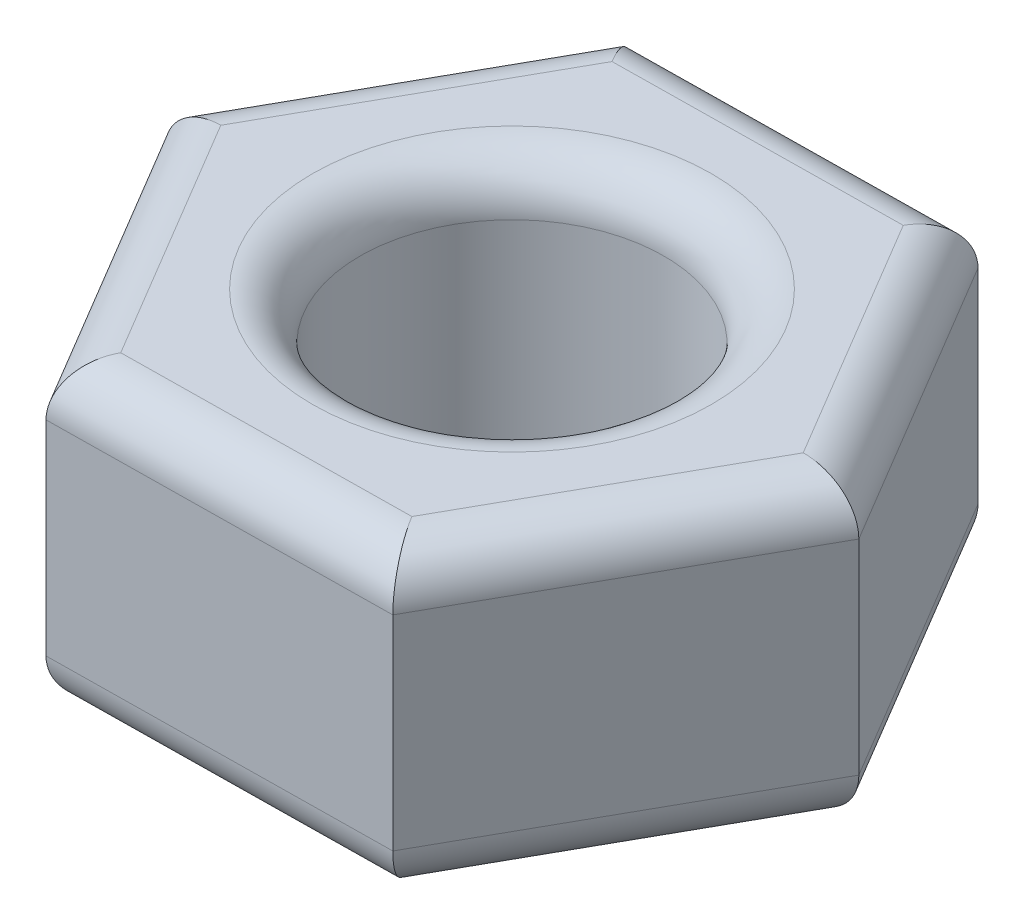
ISO-10303-21;
HEADER;
FILE_DESCRIPTION(('STEP AP214'),'2;1');
FILE_NAME('part.step','',(''),(''),'','','');
FILE_SCHEMA(('AUTOMOTIVE_DESIGN { 1 0 10303 214 1 1 1 1 }'));
ENDSEC;
DATA;
#1=APPLICATION_CONTEXT('core data for automotive mechanical design processes');
#2=APPLICATION_PROTOCOL_DEFINITION('international standard','automotive_design',2000,#1);
#3=PRODUCT_CONTEXT('',#1,'mechanical');
#4=PRODUCT('Part','Part','',(#3));
#5=PRODUCT_RELATED_PRODUCT_CATEGORY('part','',(#4));
#6=PRODUCT_DEFINITION_FORMATION('','',#4);
#7=PRODUCT_DEFINITION_CONTEXT('part definition',#1,'design');
#8=PRODUCT_DEFINITION('design','',#6,#7);
#9=PRODUCT_DEFINITION_SHAPE('','',#8);
#10=(LENGTH_UNIT() NAMED_UNIT(*) SI_UNIT(.MILLI.,.METRE.));
#11=(NAMED_UNIT(*) PLANE_ANGLE_UNIT() SI_UNIT($,.RADIAN.));
#12=(NAMED_UNIT(*) SI_UNIT($,.STERADIAN.) SOLID_ANGLE_UNIT());
#13=UNCERTAINTY_MEASURE_WITH_UNIT(LENGTH_MEASURE(1.E-05),#10,'distance_accuracy_value','');
#14=(GEOMETRIC_REPRESENTATION_CONTEXT(3) GLOBAL_UNCERTAINTY_ASSIGNED_CONTEXT((#13)) GLOBAL_UNIT_ASSIGNED_CONTEXT((#10,
#11,#12)) REPRESENTATION_CONTEXT('',''));
#15=CARTESIAN_POINT('',(0.,0.,0.));
#16=DIRECTION('',(0.,0.,1.));
#17=DIRECTION('',(1.,0.,0.));
#18=AXIS2_PLACEMENT_3D('',#15,#16,#17);
#19=CARTESIAN_POINT('',(0.,6.3,0.));
#20=DIRECTION('',(0.,1.,0.));
#21=DIRECTION('',(0.,0.,1.));
#22=AXIS2_PLACEMENT_3D('',#19,#20,#21);
#23=PLANE('',#22);
#24=CARTESIAN_POINT('',(0.,6.3,0.));
#25=DIRECTION('',(0.,1.,0.));
#26=DIRECTION('',(0.,0.,1.));
#27=AXIS2_PLACEMENT_3D('',#24,#25,#26);
#28=CIRCLE('',#27,4.2);
#29=CARTESIAN_POINT('',(0.,6.3,4.2));
#30=VERTEX_POINT('',#29);
#31=EDGE_CURVE('E11',#30,#30,#28,.F.);
#32=ORIENTED_EDGE('',*,*,#31,.T.);
#33=EDGE_LOOP('',(#32));
#34=FACE_BOUND('',#33,.T.);
#35=DIRECTION('',(0.488603073499745,0.,-0.872506181391629));
#36=VECTOR('',#35,1.);
#37=CARTESIAN_POINT('',(6.32687501312497,6.3,-0.582998073580469));
#38=LINE('',#37,#36);
#39=CARTESIAN_POINT('',(3.09102799993877,6.3,5.19530475374317));
#40=VERTEX_POINT('',#39);
#41=CARTESIAN_POINT('',(6.04477989711302,6.3,-0.0792563948844009));
#42=VERTEX_POINT('',#41);
#43=EDGE_CURVE('E51',#40,#42,#38,.T.);
#44=ORIENTED_EDGE('',*,*,#43,.T.);
#45=DIRECTION('',(-0.511310981294231,0.,-0.85939576471375));
#46=VECTOR('',#45,1.);
#47=CARTESIAN_POINT('',(2.6585463644844,6.3,-5.77073352472547));
#48=LINE('',#47,#46);
#49=CARTESIAN_POINT('',(2.95375189717424,6.3,-5.27456114862756));
#50=VERTEX_POINT('',#49);
#51=EDGE_CURVE('E43',#42,#50,#48,.T.);
#52=ORIENTED_EDGE('',*,*,#51,.T.);
#53=DIRECTION('',(-0.999914054793977,0.,0.0131104166778805));
#54=VECTOR('',#53,1.);
#55=CARTESIAN_POINT('',(-3.66832864864057,6.3,-5.18773545114499));
#56=LINE('',#55,#54);
#57=CARTESIAN_POINT('',(-3.09102799993877,6.3,-5.19530475374315));
#58=VERTEX_POINT('',#57);
#59=EDGE_CURVE('E190',#50,#58,#56,.T.);
#60=ORIENTED_EDGE('',*,*,#59,.T.);
#61=DIRECTION('',(-0.488603073499745,0.,0.872506181391629));
#62=VECTOR('',#61,1.);
#63=CARTESIAN_POINT('',(-6.32687501312497,6.3,0.582998073580482));
#64=LINE('',#63,#62);
#65=CARTESIAN_POINT('',(-6.04477989711301,6.3,0.0792563948844128));
#66=VERTEX_POINT('',#65);
#67=EDGE_CURVE('E192',#58,#66,#64,.T.);
#68=ORIENTED_EDGE('',*,*,#67,.T.);
#69=DIRECTION('',(0.511310981294231,0.,0.85939576471375));
#70=VECTOR('',#69,1.);
#71=CARTESIAN_POINT('',(-2.6585463644844,6.3,5.77073352472548));
#72=LINE('',#71,#70);
#73=CARTESIAN_POINT('',(-2.95375189717423,6.3,5.27456114862758));
#74=VERTEX_POINT('',#73);
#75=EDGE_CURVE('E194',#66,#74,#72,.T.);
#76=ORIENTED_EDGE('',*,*,#75,.T.);
#77=DIRECTION('',(0.999914054793977,0.,-0.0131104166778789));
#78=VECTOR('',#77,1.);
#79=CARTESIAN_POINT('',(3.66832864864057,6.3,5.18773545114501));
#80=LINE('',#79,#78);
#81=EDGE_CURVE('E56',#74,#40,#80,.T.);
#82=ORIENTED_EDGE('',*,*,#81,.T.);
#83=EDGE_LOOP('',(#44,#52,#60,#68,#76,#82));
#84=FACE_BOUND('',#83,.T.);
#85=ADVANCED_FACE('F34',(#34,#84),#23,.T.);
#86=CARTESIAN_POINT('',(0.,0.,0.));
#87=DIRECTION('',(0.,1.,0.));
#88=DIRECTION('',(0.,0.,1.));
#89=AXIS2_PLACEMENT_3D('',#86,#87,#88);
#90=PLANE('',#89);
#91=CARTESIAN_POINT('',(0.,0.,0.));
#92=DIRECTION('',(0.,1.,0.));
#93=DIRECTION('',(0.,0.,1.));
#94=AXIS2_PLACEMENT_3D('',#91,#92,#93);
#95=CIRCLE('',#94,4.2);
#96=CARTESIAN_POINT('',(0.,0.,4.2));
#97=VERTEX_POINT('',#96);
#98=EDGE_CURVE('E152',#97,#97,#95,.T.);
#99=ORIENTED_EDGE('',*,*,#98,.T.);
#100=EDGE_LOOP('',(#99));
#101=FACE_BOUND('',#100,.T.);
#102=DIRECTION('',(0.511310981294231,0.,0.85939576471375));
#103=VECTOR('',#102,1.);
#104=CARTESIAN_POINT('',(-4.49926589714363,0.,2.67690877175598));
#105=LINE('',#104,#103);
#106=CARTESIAN_POINT('',(-2.95375189717423,0.,5.27456114862757));
#107=VERTEX_POINT('',#106);
#108=CARTESIAN_POINT('',(-6.04477989711301,0.,0.0792563948844118));
#109=VERTEX_POINT('',#108);
#110=EDGE_CURVE('E151',#107,#109,#105,.F.);
#111=ORIENTED_EDGE('',*,*,#110,.T.);
#112=DIRECTION('',(-0.488603073499745,0.,0.872506181391629));
#113=VECTOR('',#112,1.);
#114=CARTESIAN_POINT('',(-4.56790394852589,0.,-2.55802417942937));
#115=LINE('',#114,#113);
#116=CARTESIAN_POINT('',(-3.09102799993877,0.,-5.19530475374315));
#117=VERTEX_POINT('',#116);
#118=EDGE_CURVE('E130',#109,#117,#115,.F.);
#119=ORIENTED_EDGE('',*,*,#118,.T.);
#120=DIRECTION('',(-0.999914054793977,0.,0.0131104166778805));
#121=VECTOR('',#120,1.);
#122=CARTESIAN_POINT('',(-0.0686380513822736,0.,-5.23493295118536));
#123=LINE('',#122,#121);
#124=CARTESIAN_POINT('',(2.95375189717424,0.,-5.27456114862756));
#125=VERTEX_POINT('',#124);
#126=EDGE_CURVE('E140',#117,#125,#123,.F.);
#127=ORIENTED_EDGE('',*,*,#126,.T.);
#128=DIRECTION('',(-0.511310981294231,0.,-0.85939576471375));
#129=VECTOR('',#128,1.);
#130=CARTESIAN_POINT('',(4.49926589714363,0.,-2.67690877175598));
#131=LINE('',#130,#129);
#132=CARTESIAN_POINT('',(6.04477989711302,0.,-0.0792563948844006));
#133=VERTEX_POINT('',#132);
#134=EDGE_CURVE('E146',#125,#133,#131,.F.);
#135=ORIENTED_EDGE('',*,*,#134,.T.);
#136=DIRECTION('',(0.488603073499745,0.,-0.872506181391629));
#137=VECTOR('',#136,1.);
#138=CARTESIAN_POINT('',(4.5679039485259,0.,2.55802417942937));
#139=LINE('',#138,#137);
#140=CARTESIAN_POINT('',(3.09102799993877,0.,5.19530475374317));
#141=VERTEX_POINT('',#140);
#142=EDGE_CURVE('E252',#133,#141,#139,.F.);
#143=ORIENTED_EDGE('',*,*,#142,.T.);
#144=DIRECTION('',(0.999914054793977,0.,-0.0131104166778789));
#145=VECTOR('',#144,1.);
#146=CARTESIAN_POINT('',(0.0686380513822657,0.,5.23493295118537));
#147=LINE('',#146,#145);
#148=EDGE_CURVE('E157',#141,#107,#147,.F.);
#149=ORIENTED_EDGE('',*,*,#148,.T.);
#150=EDGE_LOOP('',(#111,#119,#127,#135,#143,#149));
#151=FACE_BOUND('',#150,.T.);
#152=ADVANCED_FACE('F149',(#101,#151),#90,.F.);
#153=CARTESIAN_POINT('',(3.51794212919815,6.3,-6.2820445060197));
#154=DIRECTION('',(0.0131104166778805,0.,0.999914054793977));
#155=DIRECTION('',(0.999914054793977,0.,-0.0131104166778805));
#156=AXIS2_PLACEMENT_3D('',#153,#154,#155);
#157=PLANE('',#156);
#158=DIRECTION('',(0.,-1.,0.));
#159=VECTOR('',#158,1.);
#160=CARTESIAN_POINT('',(3.51794212919815,6.3,-6.2820445060197));
#161=LINE('',#160,#159);
#162=CARTESIAN_POINT('',(3.51794212919815,5.3,-6.2820445060197));
#163=VERTEX_POINT('',#162);
#164=CARTESIAN_POINT('',(3.51794212919815,1.,-6.2820445060197));
#165=VERTEX_POINT('',#164);
#166=EDGE_CURVE('E209',#163,#165,#161,.T.);
#167=ORIENTED_EDGE('',*,*,#166,.T.);
#168=DIRECTION('',(-0.999914054793977,0.,0.0131104166778805));
#169=VECTOR('',#168,1.);
#170=CARTESIAN_POINT('',(3.51794212919815,1.,-6.2820445060197));
#171=LINE('',#170,#169);
#172=CARTESIAN_POINT('',(-3.68143906531845,1.,-6.18764950593896));
#173=VERTEX_POINT('',#172);
#174=EDGE_CURVE('E188',#165,#173,#171,.T.);
#175=ORIENTED_EDGE('',*,*,#174,.T.);
#176=DIRECTION('',(0.,-1.,0.));
#177=VECTOR('',#176,1.);
#178=CARTESIAN_POINT('',(-3.68143906531845,6.3,-6.18764950593896));
#179=LINE('',#178,#177);
#180=CARTESIAN_POINT('',(-3.68143906531845,5.3,-6.18764950593896));
#181=VERTEX_POINT('',#180);
#182=EDGE_CURVE('E147',#181,#173,#179,.T.);
#183=ORIENTED_EDGE('',*,*,#182,.F.);
#184=DIRECTION('',(-0.999914054793977,0.,0.0131104166778805));
#185=VECTOR('',#184,1.);
#186=CARTESIAN_POINT('',(3.51794212919815,5.3,-6.2820445060197));
#187=LINE('',#186,#185);
#188=EDGE_CURVE('E186',#181,#163,#187,.F.);
#189=ORIENTED_EDGE('',*,*,#188,.T.);
#190=EDGE_LOOP('',(#167,#175,#183,#189));
#191=FACE_BOUND('',#190,.T.);
#192=ADVANCED_FACE('F276',(#191),#157,.F.);
#193=CARTESIAN_POINT('',(-3.68143906531845,6.3,-6.18764950593896));
#194=DIRECTION('',(0.872506181391629,0.,0.488603073499745));
#195=DIRECTION('',(0.488603073499745,0.,-0.872506181391629));
#196=AXIS2_PLACEMENT_3D('',#193,#194,#195);
#197=PLANE('',#196);
#198=ORIENTED_EDGE('',*,*,#182,.T.);
#199=DIRECTION('',(-0.488603073499745,0.,0.872506181391629));
#200=VECTOR('',#199,1.);
#201=CARTESIAN_POINT('',(-3.68143906531845,1.,-6.18764950593896));
#202=LINE('',#201,#200);
#203=CARTESIAN_POINT('',(-7.19938119451659,1.,0.0943950000807355));
#204=VERTEX_POINT('',#203);
#205=EDGE_CURVE('E133',#173,#204,#202,.T.);
#206=ORIENTED_EDGE('',*,*,#205,.T.);
#207=DIRECTION('',(0.,-1.,0.));
#208=VECTOR('',#207,1.);
#209=CARTESIAN_POINT('',(-7.19938119451659,6.3,0.0943950000807355));
#210=LINE('',#209,#208);
#211=CARTESIAN_POINT('',(-7.19938119451659,5.3,0.0943950000807355));
#212=VERTEX_POINT('',#211);
#213=EDGE_CURVE('E238',#212,#204,#210,.T.);
#214=ORIENTED_EDGE('',*,*,#213,.F.);
#215=DIRECTION('',(-0.488603073499745,0.,0.872506181391629));
#216=VECTOR('',#215,1.);
#217=CARTESIAN_POINT('',(-3.68143906531845,5.3,-6.18764950593896));
#218=LINE('',#217,#216);
#219=EDGE_CURVE('E166',#212,#181,#218,.F.);
#220=ORIENTED_EDGE('',*,*,#219,.T.);
#221=EDGE_LOOP('',(#198,#206,#214,#220));
#222=FACE_BOUND('',#221,.T.);
#223=ADVANCED_FACE('F243',(#222),#197,.F.);
#224=CARTESIAN_POINT('',(-7.19938119451659,6.3,0.0943950000807355));
#225=DIRECTION('',(0.85939576471375,0.,-0.511310981294231));
#226=DIRECTION('',(-0.511310981294231,0.,-0.85939576471375));
#227=AXIS2_PLACEMENT_3D('',#224,#225,#226);
#228=PLANE('',#227);
#229=ORIENTED_EDGE('',*,*,#213,.T.);
#230=DIRECTION('',(0.511310981294231,0.,0.85939576471375));
#231=VECTOR('',#230,1.);
#232=CARTESIAN_POINT('',(-7.19938119451659,1.,0.0943950000807355));
#233=LINE('',#232,#231);
#234=CARTESIAN_POINT('',(-3.51794212919814,1.,6.28204450601971));
#235=VERTEX_POINT('',#234);
#236=EDGE_CURVE('E171',#204,#235,#233,.T.);
#237=ORIENTED_EDGE('',*,*,#236,.T.);
#238=DIRECTION('',(0.,-1.,0.));
#239=VECTOR('',#238,1.);
#240=CARTESIAN_POINT('',(-3.51794212919814,6.3,6.28204450601971));
#241=LINE('',#240,#239);
#242=CARTESIAN_POINT('',(-3.51794212919814,5.3,6.28204450601971));
#243=VERTEX_POINT('',#242);
#244=EDGE_CURVE('E240',#243,#235,#241,.T.);
#245=ORIENTED_EDGE('',*,*,#244,.F.);
#246=DIRECTION('',(0.511310981294231,0.,0.85939576471375));
#247=VECTOR('',#246,1.);
#248=CARTESIAN_POINT('',(-7.19938119451659,5.3,0.0943950000807349));
#249=LINE('',#248,#247);
#250=EDGE_CURVE('E169',#243,#212,#249,.F.);
#251=ORIENTED_EDGE('',*,*,#250,.T.);
#252=EDGE_LOOP('',(#229,#237,#245,#251));
#253=FACE_BOUND('',#252,.T.);
#254=ADVANCED_FACE('F237',(#253),#228,.F.);
#255=CARTESIAN_POINT('',(-3.51794212919814,6.3,6.28204450601971));
#256=DIRECTION('',(-0.0131104166778789,0.,-0.999914054793977));
#257=DIRECTION('',(-0.999914054793977,0.,0.0131104166778789));
#258=AXIS2_PLACEMENT_3D('',#255,#256,#257);
#259=PLANE('',#258);
#260=ORIENTED_EDGE('',*,*,#244,.T.);
#261=DIRECTION('',(0.999914054793977,0.,-0.0131104166778789));
#262=VECTOR('',#261,1.);
#263=CARTESIAN_POINT('',(-3.51794212919814,1.,6.28204450601971));
#264=LINE('',#263,#262);
#265=CARTESIAN_POINT('',(3.68143906531845,1.,6.18764950593899));
#266=VERTEX_POINT('',#265);
#267=EDGE_CURVE('E175',#235,#266,#264,.T.);
#268=ORIENTED_EDGE('',*,*,#267,.T.);
#269=DIRECTION('',(0.,-1.,0.));
#270=VECTOR('',#269,1.);
#271=CARTESIAN_POINT('',(3.68143906531845,6.3,6.18764950593899));
#272=LINE('',#271,#270);
#273=CARTESIAN_POINT('',(3.68143906531845,5.3,6.18764950593899));
#274=VERTEX_POINT('',#273);
#275=EDGE_CURVE('E247',#274,#266,#272,.T.);
#276=ORIENTED_EDGE('',*,*,#275,.F.);
#277=DIRECTION('',(0.999914054793977,0.,-0.0131104166778789));
#278=VECTOR('',#277,1.);
#279=CARTESIAN_POINT('',(-3.51794212919815,5.3,6.28204450601971));
#280=LINE('',#279,#278);
#281=EDGE_CURVE('E173',#274,#243,#280,.F.);
#282=ORIENTED_EDGE('',*,*,#281,.T.);
#283=EDGE_LOOP('',(#260,#268,#276,#282));
#284=FACE_BOUND('',#283,.T.);
#285=ADVANCED_FACE('F264',(#284),#259,.F.);
#286=CARTESIAN_POINT('',(3.68143906531845,6.3,6.18764950593899));
#287=DIRECTION('',(-0.872506181391629,0.,-0.488603073499745));
#288=DIRECTION('',(-0.488603073499745,0.,0.872506181391629));
#289=AXIS2_PLACEMENT_3D('',#286,#287,#288);
#290=PLANE('',#289);
#291=ORIENTED_EDGE('',*,*,#275,.T.);
#292=DIRECTION('',(0.488603073499745,0.,-0.872506181391629));
#293=VECTOR('',#292,1.);
#294=CARTESIAN_POINT('',(3.68143906531845,1.,6.18764950593899));
#295=LINE('',#294,#293);
#296=CARTESIAN_POINT('',(7.1993811945166,1.,-0.0943950000807242));
#297=VERTEX_POINT('',#296);
#298=EDGE_CURVE('E179',#266,#297,#295,.T.);
#299=ORIENTED_EDGE('',*,*,#298,.T.);
#300=DIRECTION('',(0.,-1.,0.));
#301=VECTOR('',#300,1.);
#302=CARTESIAN_POINT('',(7.1993811945166,6.3,-0.0943950000807242));
#303=LINE('',#302,#301);
#304=CARTESIAN_POINT('',(7.1993811945166,5.3,-0.0943950000807242));
#305=VERTEX_POINT('',#304);
#306=EDGE_CURVE('E269',#305,#297,#303,.T.);
#307=ORIENTED_EDGE('',*,*,#306,.F.);
#308=DIRECTION('',(0.488603073499745,0.,-0.872506181391629));
#309=VECTOR('',#308,1.);
#310=CARTESIAN_POINT('',(3.68143906531845,5.3,6.18764950593898));
#311=LINE('',#310,#309);
#312=EDGE_CURVE('E177',#305,#274,#311,.F.);
#313=ORIENTED_EDGE('',*,*,#312,.T.);
#314=EDGE_LOOP('',(#291,#299,#307,#313));
#315=FACE_BOUND('',#314,.T.);
#316=ADVANCED_FACE('F287',(#315),#290,.F.);
#317=CARTESIAN_POINT('',(7.1993811945166,6.3,-0.0943950000807242));
#318=DIRECTION('',(-0.85939576471375,0.,0.511310981294231));
#319=DIRECTION('',(0.511310981294231,0.,0.85939576471375));
#320=AXIS2_PLACEMENT_3D('',#317,#318,#319);
#321=PLANE('',#320);
#322=ORIENTED_EDGE('',*,*,#306,.T.);
#323=DIRECTION('',(-0.511310981294231,0.,-0.85939576471375));
#324=VECTOR('',#323,1.);
#325=CARTESIAN_POINT('',(7.1993811945166,1.,-0.0943950000807242));
#326=LINE('',#325,#324);
#327=EDGE_CURVE('E184',#297,#165,#326,.T.);
#328=ORIENTED_EDGE('',*,*,#327,.T.);
#329=ORIENTED_EDGE('',*,*,#166,.F.);
#330=DIRECTION('',(-0.511310981294231,0.,-0.85939576471375));
#331=VECTOR('',#330,1.);
#332=CARTESIAN_POINT('',(7.1993811945166,5.3,-0.0943950000807244));
#333=LINE('',#332,#331);
#334=EDGE_CURVE('E181',#163,#305,#333,.F.);
#335=ORIENTED_EDGE('',*,*,#334,.T.);
#336=EDGE_LOOP('',(#322,#328,#329,#335));
#337=FACE_BOUND('',#336,.T.);
#338=ADVANCED_FACE('F288',(#337),#321,.F.);
#339=CARTESIAN_POINT('',(0.,6.3,0.));
#340=DIRECTION('',(0.,-1.,0.));
#341=DIRECTION('',(0.,0.,-1.));
#342=AXIS2_PLACEMENT_3D('',#339,#340,#341);
#343=CYLINDRICAL_SURFACE('',#342,3.2);
#344=CARTESIAN_POINT('',(0.,1.,0.));
#345=DIRECTION('',(0.,1.,0.));
#346=DIRECTION('',(0.,0.,1.));
#347=AXIS2_PLACEMENT_3D('',#344,#345,#346);
#348=CIRCLE('',#347,3.2);
#349=CARTESIAN_POINT('',(0.,1.,3.2));
#350=VERTEX_POINT('',#349);
#351=EDGE_CURVE('E163',#350,#350,#348,.F.);
#352=ORIENTED_EDGE('',*,*,#351,.T.);
#353=EDGE_LOOP('',(#352));
#354=FACE_BOUND('',#353,.T.);
#355=CARTESIAN_POINT('',(0.,5.3,0.));
#356=DIRECTION('',(0.,1.,0.));
#357=DIRECTION('',(0.,0.,1.));
#358=AXIS2_PLACEMENT_3D('',#355,#356,#357);
#359=CIRCLE('',#358,3.2);
#360=CARTESIAN_POINT('',(0.,5.3,3.2));
#361=VERTEX_POINT('',#360);
#362=EDGE_CURVE('E155',#361,#361,#359,.T.);
#363=ORIENTED_EDGE('',*,*,#362,.T.);
#364=EDGE_LOOP('',(#363));
#365=FACE_BOUND('',#364,.T.);
#366=ADVANCED_FACE('F307',(#354,#365),#343,.F.);
#367=CARTESIAN_POINT('',(0.,1.,0.));
#368=DIRECTION('',(0.,1.,0.));
#369=DIRECTION('',(0.,0.,1.));
#370=AXIS2_PLACEMENT_3D('',#367,#368,#369);
#371=TOROIDAL_SURFACE('',#370,4.2,1.);
#372=ORIENTED_EDGE('',*,*,#351,.F.);
#373=EDGE_LOOP('',(#372));
#374=FACE_BOUND('',#373,.T.);
#375=ORIENTED_EDGE('',*,*,#98,.F.);
#376=EDGE_LOOP('',(#375));
#377=FACE_BOUND('',#376,.T.);
#378=ADVANCED_FACE('F321',(#374,#377),#371,.T.);
#379=CARTESIAN_POINT('',(2.80893288392682,1.,5.69904643243924));
#380=DIRECTION('',(0.488603073499745,0.,-0.872506181391629));
#381=DIRECTION('',(-0.872506181391629,0.,-0.488603073499745));
#382=AXIS2_PLACEMENT_3D('',#379,#380,#381);
#383=CYLINDRICAL_SURFACE('',#382,1.);
#384=CARTESIAN_POINT('',(3.09102799993878,1.,5.19530475374317));
#385=DIRECTION('',(0.859395764713749,0.,-0.511310981294231));
#386=DIRECTION('',(-0.511310981294231,0.,-0.85939576471375));
#387=AXIS2_PLACEMENT_3D('',#384,#385,#386);
#388=ELLIPSE('',#387,1.15470053837925,1.);
#389=EDGE_CURVE('E203',#141,#266,#388,.F.);
#390=ORIENTED_EDGE('',*,*,#389,.F.);
#391=ORIENTED_EDGE('',*,*,#142,.F.);
#392=CARTESIAN_POINT('',(6.04477989711302,1.,-0.0792563948844003));
#393=DIRECTION('',(-0.0131104166778794,0.,-0.999914054793977));
#394=DIRECTION('',(-0.999914054793977,0.,0.0131104166778793));
#395=AXIS2_PLACEMENT_3D('',#392,#393,#394);
#396=ELLIPSE('',#395,1.15470053837925,1.);
#397=EDGE_CURVE('E206',#297,#133,#396,.T.);
#398=ORIENTED_EDGE('',*,*,#397,.F.);
#399=ORIENTED_EDGE('',*,*,#298,.F.);
#400=EDGE_LOOP('',(#390,#391,#398,#399));
#401=FACE_BOUND('',#400,.T.);
#402=ADVANCED_FACE('F285',(#401),#383,.T.);
#403=CARTESIAN_POINT('',(6.33998542980285,1.,0.416915981213507));
#404=DIRECTION('',(-0.511310981294231,0.,-0.85939576471375));
#405=DIRECTION('',(-0.85939576471375,0.,0.511310981294231));
#406=AXIS2_PLACEMENT_3D('',#403,#404,#405);
#407=CYLINDRICAL_SURFACE('',#406,1.);
#408=ORIENTED_EDGE('',*,*,#397,.T.);
#409=ORIENTED_EDGE('',*,*,#134,.F.);
#410=CARTESIAN_POINT('',(2.95375189717424,1.,-5.27456114862756));
#411=DIRECTION('',(-0.872506181391629,0.,-0.488603073499745));
#412=DIRECTION('',(-0.488603073499746,0.,0.872506181391629));
#413=AXIS2_PLACEMENT_3D('',#410,#411,#412);
#414=ELLIPSE('',#413,1.15470053837925,1.);
#415=EDGE_CURVE('E143',#165,#125,#414,.T.);
#416=ORIENTED_EDGE('',*,*,#415,.F.);
#417=ORIENTED_EDGE('',*,*,#327,.F.);
#418=EDGE_LOOP('',(#408,#409,#416,#417));
#419=FACE_BOUND('',#418,.T.);
#420=ADVANCED_FACE('F282',(#419),#407,.T.);
#421=CARTESIAN_POINT('',(-3.53105254587602,1.,5.28213045122574));
#422=DIRECTION('',(0.999914054793977,0.,-0.0131104166778789));
#423=DIRECTION('',(-0.0131104166778789,0.,-0.999914054793977));
#424=AXIS2_PLACEMENT_3D('',#421,#422,#423);
#425=CYLINDRICAL_SURFACE('',#424,1.);
#426=ORIENTED_EDGE('',*,*,#389,.T.);
#427=ORIENTED_EDGE('',*,*,#267,.F.);
#428=CARTESIAN_POINT('',(-2.95375189717423,1.,5.27456114862758));
#429=DIRECTION('',(0.872506181391629,0.,0.488603073499746));
#430=DIRECTION('',(0.488603073499746,0.,-0.872506181391629));
#431=AXIS2_PLACEMENT_3D('',#428,#429,#430);
#432=ELLIPSE('',#431,1.15470053837925,1.);
#433=EDGE_CURVE('E136',#107,#235,#432,.F.);
#434=ORIENTED_EDGE('',*,*,#433,.F.);
#435=ORIENTED_EDGE('',*,*,#148,.F.);
#436=EDGE_LOOP('',(#426,#427,#434,#435));
#437=FACE_BOUND('',#436,.T.);
#438=ADVANCED_FACE('F259',(#437),#425,.T.);
#439=CARTESIAN_POINT('',(3.53105254587603,1.,-5.28213045122573));
#440=DIRECTION('',(-0.999914054793977,0.,0.0131104166778805));
#441=DIRECTION('',(0.0131104166778805,0.,0.999914054793977));
#442=AXIS2_PLACEMENT_3D('',#439,#440,#441);
#443=CYLINDRICAL_SURFACE('',#442,1.);
#444=ORIENTED_EDGE('',*,*,#415,.T.);
#445=ORIENTED_EDGE('',*,*,#126,.F.);
#446=CARTESIAN_POINT('',(-3.09102799993877,1.,-5.19530475374315));
#447=DIRECTION('',(-0.859395764713749,0.,0.511310981294232));
#448=DIRECTION('',(-0.511310981294232,0.,-0.859395764713749));
#449=AXIS2_PLACEMENT_3D('',#446,#447,#448);
#450=ELLIPSE('',#449,1.15470053837925,1.);
#451=EDGE_CURVE('E126',#173,#117,#450,.T.);
#452=ORIENTED_EDGE('',*,*,#451,.F.);
#453=ORIENTED_EDGE('',*,*,#174,.F.);
#454=EDGE_LOOP('',(#444,#445,#452,#453));
#455=FACE_BOUND('',#454,.T.);
#456=ADVANCED_FACE('F141',(#455),#443,.T.);
#457=CARTESIAN_POINT('',(-6.33998542980285,1.,-0.416915981213495));
#458=DIRECTION('',(0.511310981294231,0.,0.85939576471375));
#459=DIRECTION('',(0.85939576471375,0.,-0.511310981294231));
#460=AXIS2_PLACEMENT_3D('',#457,#458,#459);
#461=CYLINDRICAL_SURFACE('',#460,1.);
#462=ORIENTED_EDGE('',*,*,#433,.T.);
#463=ORIENTED_EDGE('',*,*,#236,.F.);
#464=CARTESIAN_POINT('',(-6.04477989711301,1.,0.0792563948844134));
#465=DIRECTION('',(0.0131104166778794,0.,0.999914054793977));
#466=DIRECTION('',(0.999914054793977,0.,-0.0131104166778794));
#467=AXIS2_PLACEMENT_3D('',#464,#465,#466);
#468=ELLIPSE('',#467,1.15470053837925,1.);
#469=EDGE_CURVE('E137',#109,#204,#468,.F.);
#470=ORIENTED_EDGE('',*,*,#469,.F.);
#471=ORIENTED_EDGE('',*,*,#110,.F.);
#472=EDGE_LOOP('',(#462,#463,#470,#471));
#473=FACE_BOUND('',#472,.T.);
#474=ADVANCED_FACE('F262',(#473),#461,.T.);
#475=CARTESIAN_POINT('',(-2.80893288392682,1.,-5.69904643243922));
#476=DIRECTION('',(-0.488603073499745,0.,0.872506181391629));
#477=DIRECTION('',(0.872506181391629,0.,0.488603073499745));
#478=AXIS2_PLACEMENT_3D('',#475,#476,#477);
#479=CYLINDRICAL_SURFACE('',#478,1.);
#480=ORIENTED_EDGE('',*,*,#451,.T.);
#481=ORIENTED_EDGE('',*,*,#118,.F.);
#482=ORIENTED_EDGE('',*,*,#469,.T.);
#483=ORIENTED_EDGE('',*,*,#205,.F.);
#484=EDGE_LOOP('',(#480,#481,#482,#483));
#485=FACE_BOUND('',#484,.T.);
#486=ADVANCED_FACE('F128',(#485),#479,.T.);
#487=CARTESIAN_POINT('',(0.,5.3,0.));
#488=DIRECTION('',(0.,1.,0.));
#489=DIRECTION('',(0.,0.,1.));
#490=AXIS2_PLACEMENT_3D('',#487,#488,#489);
#491=TOROIDAL_SURFACE('',#490,4.2,1.);
#492=ORIENTED_EDGE('',*,*,#31,.F.);
#493=EDGE_LOOP('',(#492));
#494=FACE_BOUND('',#493,.T.);
#495=ORIENTED_EDGE('',*,*,#362,.F.);
#496=EDGE_LOOP('',(#495));
#497=FACE_BOUND('',#496,.T.);
#498=ADVANCED_FACE('F327',(#494,#497),#491,.T.);
#499=CARTESIAN_POINT('',(-4.49926589714363,5.3,2.67690877175598));
#500=DIRECTION('',(-0.511310981294231,0.,-0.85939576471375));
#501=DIRECTION('',(-0.85939576471375,0.,0.511310981294231));
#502=AXIS2_PLACEMENT_3D('',#499,#500,#501);
#503=CYLINDRICAL_SURFACE('',#502,1.);
#504=CARTESIAN_POINT('',(-6.04477989711301,5.3,0.0792563948844103));
#505=DIRECTION('',(-0.0131104166778794,0.,-0.999914054793977));
#506=DIRECTION('',(0.999914054793977,0.,-0.0131104166778794));
#507=AXIS2_PLACEMENT_3D('',#504,#505,#506);
#508=ELLIPSE('',#507,1.15470053837925,1.);
#509=EDGE_CURVE('E219',#212,#66,#508,.T.);
#510=ORIENTED_EDGE('',*,*,#509,.F.);
#511=ORIENTED_EDGE('',*,*,#250,.F.);
#512=CARTESIAN_POINT('',(-2.95375189717423,5.3,5.27456114862757));
#513=DIRECTION('',(-0.872506181391629,0.,-0.488603073499746));
#514=DIRECTION('',(0.488603073499746,0.,-0.872506181391629));
#515=AXIS2_PLACEMENT_3D('',#512,#513,#514);
#516=ELLIPSE('',#515,1.15470053837925,1.);
#517=EDGE_CURVE('E38',#74,#243,#516,.F.);
#518=ORIENTED_EDGE('',*,*,#517,.F.);
#519=ORIENTED_EDGE('',*,*,#75,.F.);
#520=EDGE_LOOP('',(#510,#511,#518,#519));
#521=FACE_BOUND('',#520,.T.);
#522=ADVANCED_FACE('F36',(#521),#503,.T.);
#523=CARTESIAN_POINT('',(0.0686380513822657,5.3,5.23493295118537));
#524=DIRECTION('',(-0.999914054793977,0.,0.0131104166778789));
#525=DIRECTION('',(0.0131104166778789,0.,0.999914054793977));
#526=AXIS2_PLACEMENT_3D('',#523,#524,#525);
#527=CYLINDRICAL_SURFACE('',#526,1.);
#528=ORIENTED_EDGE('',*,*,#517,.T.);
#529=ORIENTED_EDGE('',*,*,#281,.F.);
#530=CARTESIAN_POINT('',(3.09102799993877,5.3,5.19530475374317));
#531=DIRECTION('',(-0.859395764713749,0.,0.511310981294231));
#532=DIRECTION('',(-0.511310981294231,0.,-0.85939576471375));
#533=AXIS2_PLACEMENT_3D('',#530,#531,#532);
#534=ELLIPSE('',#533,1.15470053837925,1.);
#535=EDGE_CURVE('E217',#40,#274,#534,.F.);
#536=ORIENTED_EDGE('',*,*,#535,.F.);
#537=ORIENTED_EDGE('',*,*,#81,.F.);
#538=EDGE_LOOP('',(#528,#529,#536,#537));
#539=FACE_BOUND('',#538,.T.);
#540=ADVANCED_FACE('F229',(#539),#527,.T.);
#541=CARTESIAN_POINT('',(-4.56790394852589,5.3,-2.55802417942937));
#542=DIRECTION('',(0.488603073499745,0.,-0.872506181391629));
#543=DIRECTION('',(-0.872506181391629,0.,-0.488603073499745));
#544=AXIS2_PLACEMENT_3D('',#541,#542,#543);
#545=CYLINDRICAL_SURFACE('',#544,1.);
#546=ORIENTED_EDGE('',*,*,#509,.T.);
#547=ORIENTED_EDGE('',*,*,#67,.F.);
#548=CARTESIAN_POINT('',(-3.09102799993877,5.3,-5.19530475374315));
#549=DIRECTION('',(0.859395764713749,0.,-0.511310981294232));
#550=DIRECTION('',(0.511310981294232,0.,0.859395764713749));
#551=AXIS2_PLACEMENT_3D('',#548,#549,#550);
#552=ELLIPSE('',#551,1.15470053837925,1.);
#553=EDGE_CURVE('E214',#181,#58,#552,.T.);
#554=ORIENTED_EDGE('',*,*,#553,.F.);
#555=ORIENTED_EDGE('',*,*,#219,.F.);
#556=EDGE_LOOP('',(#546,#547,#554,#555));
#557=FACE_BOUND('',#556,.T.);
#558=ADVANCED_FACE('F348',(#557),#545,.T.);
#559=CARTESIAN_POINT('',(4.5679039485259,5.3,2.55802417942937));
#560=DIRECTION('',(-0.488603073499745,0.,0.872506181391629));
#561=DIRECTION('',(0.872506181391629,0.,0.488603073499745));
#562=AXIS2_PLACEMENT_3D('',#559,#560,#561);
#563=CYLINDRICAL_SURFACE('',#562,1.);
#564=ORIENTED_EDGE('',*,*,#535,.T.);
#565=ORIENTED_EDGE('',*,*,#312,.F.);
#566=CARTESIAN_POINT('',(6.04477989711302,5.3,-0.079256394884401));
#567=DIRECTION('',(0.0131104166778794,0.,0.999914054793977));
#568=DIRECTION('',(-0.999914054793977,0.,0.0131104166778793));
#569=AXIS2_PLACEMENT_3D('',#566,#567,#568);
#570=ELLIPSE('',#569,1.15470053837925,1.);
#571=EDGE_CURVE('E212',#42,#305,#570,.F.);
#572=ORIENTED_EDGE('',*,*,#571,.F.);
#573=ORIENTED_EDGE('',*,*,#43,.F.);
#574=EDGE_LOOP('',(#564,#565,#572,#573));
#575=FACE_BOUND('',#574,.T.);
#576=ADVANCED_FACE('F345',(#575),#563,.T.);
#577=CARTESIAN_POINT('',(-0.0686380513822736,5.3,-5.23493295118536));
#578=DIRECTION('',(0.999914054793977,0.,-0.0131104166778805));
#579=DIRECTION('',(-0.0131104166778805,0.,-0.999914054793977));
#580=AXIS2_PLACEMENT_3D('',#577,#578,#579);
#581=CYLINDRICAL_SURFACE('',#580,1.);
#582=ORIENTED_EDGE('',*,*,#553,.T.);
#583=ORIENTED_EDGE('',*,*,#59,.F.);
#584=CARTESIAN_POINT('',(2.95375189717424,5.3,-5.27456114862756));
#585=DIRECTION('',(0.872506181391629,0.,0.488603073499745));
#586=DIRECTION('',(0.488603073499746,0.,-0.872506181391629));
#587=AXIS2_PLACEMENT_3D('',#584,#585,#586);
#588=ELLIPSE('',#587,1.15470053837925,1.);
#589=EDGE_CURVE('E210',#163,#50,#588,.T.);
#590=ORIENTED_EDGE('',*,*,#589,.F.);
#591=ORIENTED_EDGE('',*,*,#188,.F.);
#592=EDGE_LOOP('',(#582,#583,#590,#591));
#593=FACE_BOUND('',#592,.T.);
#594=ADVANCED_FACE('F296',(#593),#581,.T.);
#595=CARTESIAN_POINT('',(4.49926589714363,5.3,-2.67690877175598));
#596=DIRECTION('',(0.511310981294231,0.,0.85939576471375));
#597=DIRECTION('',(0.85939576471375,0.,-0.511310981294231));
#598=AXIS2_PLACEMENT_3D('',#595,#596,#597);
#599=CYLINDRICAL_SURFACE('',#598,1.);
#600=ORIENTED_EDGE('',*,*,#571,.T.);
#601=ORIENTED_EDGE('',*,*,#334,.F.);
#602=ORIENTED_EDGE('',*,*,#589,.T.);
#603=ORIENTED_EDGE('',*,*,#51,.F.);
#604=EDGE_LOOP('',(#600,#601,#602,#603));
#605=FACE_BOUND('',#604,.T.);
#606=ADVANCED_FACE('F291',(#605),#599,.T.);
#607=CLOSED_SHELL('',(#85,#152,#192,#223,#254,#285,#316,#338,#366,#378,#402,#420,#438,#456,#474,
#486,#498,#522,#540,#558,#576,#594,#606));
#608=MANIFOLD_SOLID_BREP('B2',#607);
#609=ADVANCED_BREP_SHAPE_REPRESENTATION('',(#18,#608),#14);
#610=SHAPE_DEFINITION_REPRESENTATION(#9,#609);
ENDSEC;
END-ISO-10303-21;
